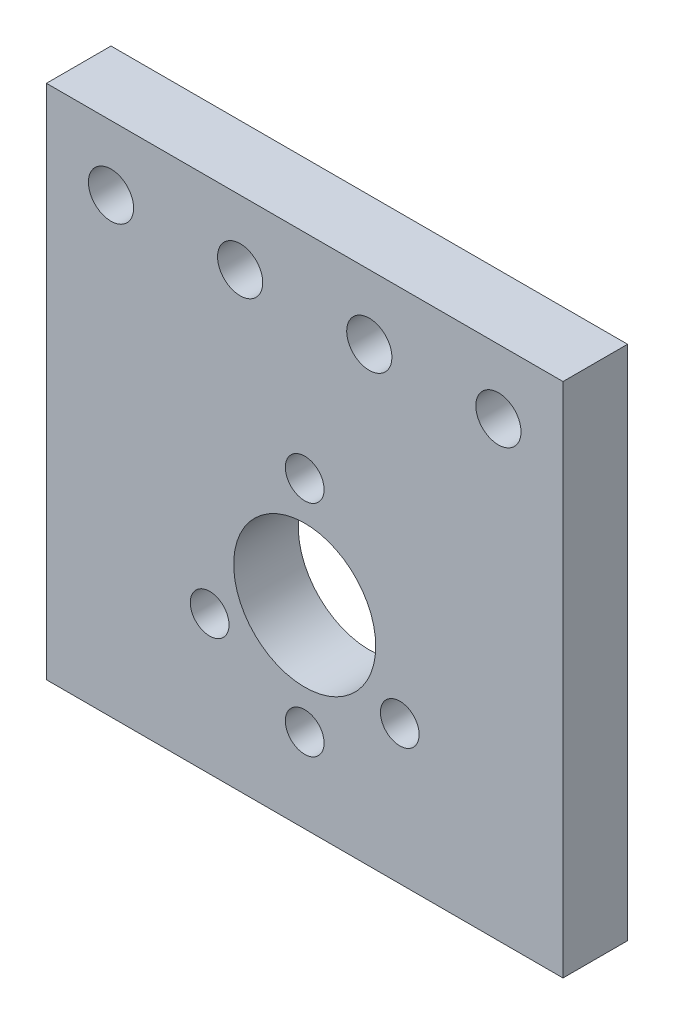
ISO-10303-21;
HEADER;
FILE_DESCRIPTION(('STEP AP214'),'2;1');
FILE_NAME('part.step','',(''),(''),'','','');
FILE_SCHEMA(('AUTOMOTIVE_DESIGN { 1 0 10303 214 1 1 1 1 }'));
ENDSEC;
DATA;
#1=APPLICATION_CONTEXT('core data for automotive mechanical design processes');
#2=APPLICATION_PROTOCOL_DEFINITION('international standard','automotive_design',2000,#1);
#3=PRODUCT_CONTEXT('',#1,'mechanical');
#4=PRODUCT('Part','Part','',(#3));
#5=PRODUCT_RELATED_PRODUCT_CATEGORY('part','',(#4));
#6=PRODUCT_DEFINITION_FORMATION('','',#4);
#7=PRODUCT_DEFINITION_CONTEXT('part definition',#1,'design');
#8=PRODUCT_DEFINITION('design','',#6,#7);
#9=PRODUCT_DEFINITION_SHAPE('','',#8);
#10=(LENGTH_UNIT() NAMED_UNIT(*) SI_UNIT(.MILLI.,.METRE.));
#11=(NAMED_UNIT(*) PLANE_ANGLE_UNIT() SI_UNIT($,.RADIAN.));
#12=(NAMED_UNIT(*) SI_UNIT($,.STERADIAN.) SOLID_ANGLE_UNIT());
#13=UNCERTAINTY_MEASURE_WITH_UNIT(LENGTH_MEASURE(1.E-05),#10,'distance_accuracy_value','');
#14=(GEOMETRIC_REPRESENTATION_CONTEXT(3) GLOBAL_UNCERTAINTY_ASSIGNED_CONTEXT((#13)) GLOBAL_UNIT_ASSIGNED_CONTEXT((#10,
#11,#12)) REPRESENTATION_CONTEXT('',''));
#15=CARTESIAN_POINT('',(0.,0.,0.));
#16=DIRECTION('',(0.,0.,1.));
#17=DIRECTION('',(1.,0.,0.));
#18=AXIS2_PLACEMENT_3D('',#15,#16,#17);
#19=CARTESIAN_POINT('',(0.,0.,5.));
#20=DIRECTION('',(0.,0.,1.));
#21=DIRECTION('',(1.,0.,0.));
#22=AXIS2_PLACEMENT_3D('',#19,#20,#21);
#23=PLANE('',#22);
#24=CARTESIAN_POINT('',(5.,20.,5.));
#25=DIRECTION('',(0.,0.,1.));
#26=DIRECTION('',(-1.,0.,0.));
#27=AXIS2_PLACEMENT_3D('',#24,#25,#26);
#28=CIRCLE('',#27,1.75);
#29=CARTESIAN_POINT('',(3.25,20.,5.));
#30=VERTEX_POINT('',#29);
#31=EDGE_CURVE('E151',#30,#30,#28,.T.);
#32=ORIENTED_EDGE('',*,*,#31,.F.);
#33=EDGE_LOOP('',(#32));
#34=FACE_BOUND('',#33,.T.);
#35=CARTESIAN_POINT('',(-15.,20.,5.));
#36=DIRECTION('',(0.,0.,1.));
#37=DIRECTION('',(1.,0.,0.));
#38=AXIS2_PLACEMENT_3D('',#35,#36,#37);
#39=CIRCLE('',#38,1.75);
#40=CARTESIAN_POINT('',(-13.25,20.,5.));
#41=VERTEX_POINT('',#40);
#42=EDGE_CURVE('E139',#41,#41,#39,.T.);
#43=ORIENTED_EDGE('',*,*,#42,.F.);
#44=EDGE_LOOP('',(#43));
#45=FACE_BOUND('',#44,.T.);
#46=CARTESIAN_POINT('',(7.36121593216774,-4.24999999999998,5.));
#47=DIRECTION('',(0.,0.,1.));
#48=DIRECTION('',(1.,0.,0.));
#49=AXIS2_PLACEMENT_3D('',#46,#47,#48);
#50=CIRCLE('',#49,1.5);
#51=CARTESIAN_POINT('',(8.86121593216774,-4.24999999999998,5.));
#52=VERTEX_POINT('',#51);
#53=EDGE_CURVE('E127',#52,#52,#50,.T.);
#54=ORIENTED_EDGE('',*,*,#53,.F.);
#55=EDGE_LOOP('',(#54));
#56=FACE_BOUND('',#55,.T.);
#57=CARTESIAN_POINT('',(0.,-8.5,5.));
#58=DIRECTION('',(0.,0.,1.));
#59=DIRECTION('',(1.,0.,0.));
#60=AXIS2_PLACEMENT_3D('',#57,#58,#59);
#61=CIRCLE('',#60,1.5);
#62=CARTESIAN_POINT('',(1.5,-8.5,5.));
#63=VERTEX_POINT('',#62);
#64=EDGE_CURVE('E115',#63,#63,#61,.T.);
#65=ORIENTED_EDGE('',*,*,#64,.F.);
#66=EDGE_LOOP('',(#65));
#67=FACE_BOUND('',#66,.T.);
#68=DIRECTION('',(0.,-1.,0.));
#69=VECTOR('',#68,1.);
#70=CARTESIAN_POINT('',(-20.,25.,5.));
#71=LINE('',#70,#69);
#72=CARTESIAN_POINT('',(-20.,25.,5.));
#73=VERTEX_POINT('',#72);
#74=CARTESIAN_POINT('',(-20.,-15.,5.));
#75=VERTEX_POINT('',#74);
#76=EDGE_CURVE('E85',#73,#75,#71,.T.);
#77=ORIENTED_EDGE('',*,*,#76,.T.);
#78=DIRECTION('',(1.,0.,0.));
#79=VECTOR('',#78,1.);
#80=CARTESIAN_POINT('',(-20.,-15.,5.));
#81=LINE('',#80,#79);
#82=CARTESIAN_POINT('',(20.,-15.,5.));
#83=VERTEX_POINT('',#82);
#84=EDGE_CURVE('E80',#75,#83,#81,.T.);
#85=ORIENTED_EDGE('',*,*,#84,.T.);
#86=DIRECTION('',(0.,1.,0.));
#87=VECTOR('',#86,1.);
#88=CARTESIAN_POINT('',(20.,25.,5.));
#89=LINE('',#88,#87);
#90=CARTESIAN_POINT('',(20.,25.,5.));
#91=VERTEX_POINT('',#90);
#92=EDGE_CURVE('E83',#83,#91,#89,.T.);
#93=ORIENTED_EDGE('',*,*,#92,.T.);
#94=DIRECTION('',(-1.,0.,0.));
#95=VECTOR('',#94,1.);
#96=CARTESIAN_POINT('',(-20.,25.,5.));
#97=LINE('',#96,#95);
#98=EDGE_CURVE('E50',#91,#73,#97,.T.);
#99=ORIENTED_EDGE('',*,*,#98,.T.);
#100=EDGE_LOOP('',(#77,#85,#93,#99));
#101=FACE_BOUND('',#100,.T.);
#102=CARTESIAN_POINT('',(0.,0.,5.));
#103=DIRECTION('',(0.,0.,1.));
#104=DIRECTION('',(1.,0.,0.));
#105=AXIS2_PLACEMENT_3D('',#102,#103,#104);
#106=CIRCLE('',#105,5.5);
#107=CARTESIAN_POINT('',(5.5,0.,5.));
#108=VERTEX_POINT('',#107);
#109=EDGE_CURVE('E100',#108,#108,#106,.T.);
#110=ORIENTED_EDGE('',*,*,#109,.F.);
#111=EDGE_LOOP('',(#110));
#112=FACE_BOUND('',#111,.T.);
#113=CARTESIAN_POINT('',(0.,8.5,5.));
#114=DIRECTION('',(0.,0.,1.));
#115=DIRECTION('',(1.,0.,0.));
#116=AXIS2_PLACEMENT_3D('',#113,#114,#115);
#117=CIRCLE('',#116,1.5);
#118=CARTESIAN_POINT('',(1.5,8.5,5.));
#119=VERTEX_POINT('',#118);
#120=EDGE_CURVE('E121',#119,#119,#117,.T.);
#121=ORIENTED_EDGE('',*,*,#120,.F.);
#122=EDGE_LOOP('',(#121));
#123=FACE_BOUND('',#122,.T.);
#124=CARTESIAN_POINT('',(-7.36121593216771,-4.25000000000003,5.));
#125=DIRECTION('',(0.,0.,1.));
#126=DIRECTION('',(-1.,0.,0.));
#127=AXIS2_PLACEMENT_3D('',#124,#125,#126);
#128=CIRCLE('',#127,1.5);
#129=CARTESIAN_POINT('',(-8.86121593216771,-4.25000000000003,5.));
#130=VERTEX_POINT('',#129);
#131=EDGE_CURVE('E133',#130,#130,#128,.T.);
#132=ORIENTED_EDGE('',*,*,#131,.F.);
#133=EDGE_LOOP('',(#132));
#134=FACE_BOUND('',#133,.T.);
#135=CARTESIAN_POINT('',(-5.,20.,5.));
#136=DIRECTION('',(0.,0.,1.));
#137=DIRECTION('',(1.,0.,0.));
#138=AXIS2_PLACEMENT_3D('',#135,#136,#137);
#139=CIRCLE('',#138,1.75);
#140=CARTESIAN_POINT('',(-3.25,20.,5.));
#141=VERTEX_POINT('',#140);
#142=EDGE_CURVE('E145',#141,#141,#139,.T.);
#143=ORIENTED_EDGE('',*,*,#142,.F.);
#144=EDGE_LOOP('',(#143));
#145=FACE_BOUND('',#144,.T.);
#146=CARTESIAN_POINT('',(15.,20.,5.));
#147=DIRECTION('',(0.,0.,1.));
#148=DIRECTION('',(-1.,0.,0.));
#149=AXIS2_PLACEMENT_3D('',#146,#147,#148);
#150=CIRCLE('',#149,1.75);
#151=CARTESIAN_POINT('',(13.25,20.,5.));
#152=VERTEX_POINT('',#151);
#153=EDGE_CURVE('E157',#152,#152,#150,.T.);
#154=ORIENTED_EDGE('',*,*,#153,.F.);
#155=EDGE_LOOP('',(#154));
#156=FACE_BOUND('',#155,.T.);
#157=ADVANCED_FACE('F33',(#34,#45,#56,#67,#101,#112,#123,#134,#145,#156),#23,.T.);
#158=CARTESIAN_POINT('',(0.,0.,0.));
#159=DIRECTION('',(0.,0.,1.));
#160=DIRECTION('',(1.,0.,0.));
#161=AXIS2_PLACEMENT_3D('',#158,#159,#160);
#162=PLANE('',#161);
#163=CARTESIAN_POINT('',(5.,20.,0.));
#164=DIRECTION('',(0.,0.,1.));
#165=DIRECTION('',(-1.,0.,0.));
#166=AXIS2_PLACEMENT_3D('',#163,#164,#165);
#167=CIRCLE('',#166,1.75);
#168=CARTESIAN_POINT('',(3.25,20.,0.));
#169=VERTEX_POINT('',#168);
#170=EDGE_CURVE('E154',#169,#169,#167,.T.);
#171=ORIENTED_EDGE('',*,*,#170,.T.);
#172=EDGE_LOOP('',(#171));
#173=FACE_BOUND('',#172,.T.);
#174=CARTESIAN_POINT('',(-15.,20.,0.));
#175=DIRECTION('',(0.,0.,1.));
#176=DIRECTION('',(1.,0.,0.));
#177=AXIS2_PLACEMENT_3D('',#174,#175,#176);
#178=CIRCLE('',#177,1.75);
#179=CARTESIAN_POINT('',(-13.25,20.,0.));
#180=VERTEX_POINT('',#179);
#181=EDGE_CURVE('E142',#180,#180,#178,.T.);
#182=ORIENTED_EDGE('',*,*,#181,.T.);
#183=EDGE_LOOP('',(#182));
#184=FACE_BOUND('',#183,.T.);
#185=CARTESIAN_POINT('',(7.36121593216774,-4.24999999999998,0.));
#186=DIRECTION('',(0.,0.,1.));
#187=DIRECTION('',(1.,0.,0.));
#188=AXIS2_PLACEMENT_3D('',#185,#186,#187);
#189=CIRCLE('',#188,1.5);
#190=CARTESIAN_POINT('',(8.86121593216774,-4.24999999999998,0.));
#191=VERTEX_POINT('',#190);
#192=EDGE_CURVE('E130',#191,#191,#189,.T.);
#193=ORIENTED_EDGE('',*,*,#192,.T.);
#194=EDGE_LOOP('',(#193));
#195=FACE_BOUND('',#194,.T.);
#196=CARTESIAN_POINT('',(0.,-8.5,0.));
#197=DIRECTION('',(0.,0.,1.));
#198=DIRECTION('',(1.,0.,0.));
#199=AXIS2_PLACEMENT_3D('',#196,#197,#198);
#200=CIRCLE('',#199,1.5);
#201=CARTESIAN_POINT('',(1.5,-8.5,0.));
#202=VERTEX_POINT('',#201);
#203=EDGE_CURVE('E118',#202,#202,#200,.T.);
#204=ORIENTED_EDGE('',*,*,#203,.T.);
#205=EDGE_LOOP('',(#204));
#206=FACE_BOUND('',#205,.T.);
#207=DIRECTION('',(0.,-1.,0.));
#208=VECTOR('',#207,1.);
#209=CARTESIAN_POINT('',(-20.,25.,0.));
#210=LINE('',#209,#208);
#211=CARTESIAN_POINT('',(-20.,25.,0.));
#212=VERTEX_POINT('',#211);
#213=CARTESIAN_POINT('',(-20.,-15.,0.));
#214=VERTEX_POINT('',#213);
#215=EDGE_CURVE('E97',#212,#214,#210,.T.);
#216=ORIENTED_EDGE('',*,*,#215,.F.);
#217=DIRECTION('',(-1.,0.,0.));
#218=VECTOR('',#217,1.);
#219=CARTESIAN_POINT('',(-20.,25.,0.));
#220=LINE('',#219,#218);
#221=CARTESIAN_POINT('',(20.,25.,0.));
#222=VERTEX_POINT('',#221);
#223=EDGE_CURVE('E73',#222,#212,#220,.T.);
#224=ORIENTED_EDGE('',*,*,#223,.F.);
#225=DIRECTION('',(0.,1.,0.));
#226=VECTOR('',#225,1.);
#227=CARTESIAN_POINT('',(20.,25.,0.));
#228=LINE('',#227,#226);
#229=CARTESIAN_POINT('',(20.,-15.,0.));
#230=VERTEX_POINT('',#229);
#231=EDGE_CURVE('E67',#230,#222,#228,.T.);
#232=ORIENTED_EDGE('',*,*,#231,.F.);
#233=DIRECTION('',(1.,0.,0.));
#234=VECTOR('',#233,1.);
#235=CARTESIAN_POINT('',(-20.,-15.,0.));
#236=LINE('',#235,#234);
#237=EDGE_CURVE('E89',#214,#230,#236,.T.);
#238=ORIENTED_EDGE('',*,*,#237,.F.);
#239=EDGE_LOOP('',(#216,#224,#232,#238));
#240=FACE_BOUND('',#239,.T.);
#241=CARTESIAN_POINT('',(0.,0.,0.));
#242=DIRECTION('',(0.,0.,1.));
#243=DIRECTION('',(1.,0.,0.));
#244=AXIS2_PLACEMENT_3D('',#241,#242,#243);
#245=CIRCLE('',#244,5.5);
#246=CARTESIAN_POINT('',(5.5,0.,0.));
#247=VERTEX_POINT('',#246);
#248=EDGE_CURVE('E112',#247,#247,#245,.T.);
#249=ORIENTED_EDGE('',*,*,#248,.T.);
#250=EDGE_LOOP('',(#249));
#251=FACE_BOUND('',#250,.T.);
#252=CARTESIAN_POINT('',(0.,8.5,0.));
#253=DIRECTION('',(0.,0.,1.));
#254=DIRECTION('',(1.,0.,0.));
#255=AXIS2_PLACEMENT_3D('',#252,#253,#254);
#256=CIRCLE('',#255,1.5);
#257=CARTESIAN_POINT('',(1.5,8.5,0.));
#258=VERTEX_POINT('',#257);
#259=EDGE_CURVE('E124',#258,#258,#256,.T.);
#260=ORIENTED_EDGE('',*,*,#259,.T.);
#261=EDGE_LOOP('',(#260));
#262=FACE_BOUND('',#261,.T.);
#263=CARTESIAN_POINT('',(-7.36121593216771,-4.25000000000003,0.));
#264=DIRECTION('',(0.,0.,1.));
#265=DIRECTION('',(-1.,0.,0.));
#266=AXIS2_PLACEMENT_3D('',#263,#264,#265);
#267=CIRCLE('',#266,1.5);
#268=CARTESIAN_POINT('',(-8.86121593216771,-4.25000000000003,0.));
#269=VERTEX_POINT('',#268);
#270=EDGE_CURVE('E136',#269,#269,#267,.T.);
#271=ORIENTED_EDGE('',*,*,#270,.T.);
#272=EDGE_LOOP('',(#271));
#273=FACE_BOUND('',#272,.T.);
#274=CARTESIAN_POINT('',(-5.,20.,0.));
#275=DIRECTION('',(0.,0.,1.));
#276=DIRECTION('',(1.,0.,0.));
#277=AXIS2_PLACEMENT_3D('',#274,#275,#276);
#278=CIRCLE('',#277,1.75);
#279=CARTESIAN_POINT('',(-3.25,20.,0.));
#280=VERTEX_POINT('',#279);
#281=EDGE_CURVE('E148',#280,#280,#278,.T.);
#282=ORIENTED_EDGE('',*,*,#281,.T.);
#283=EDGE_LOOP('',(#282));
#284=FACE_BOUND('',#283,.T.);
#285=CARTESIAN_POINT('',(15.,20.,0.));
#286=DIRECTION('',(0.,0.,1.));
#287=DIRECTION('',(-1.,0.,0.));
#288=AXIS2_PLACEMENT_3D('',#285,#286,#287);
#289=CIRCLE('',#288,1.75);
#290=CARTESIAN_POINT('',(13.25,20.,0.));
#291=VERTEX_POINT('',#290);
#292=EDGE_CURVE('E160',#291,#291,#289,.T.);
#293=ORIENTED_EDGE('',*,*,#292,.T.);
#294=EDGE_LOOP('',(#293));
#295=FACE_BOUND('',#294,.T.);
#296=ADVANCED_FACE('F108',(#173,#184,#195,#206,#240,#251,#262,#273,#284,#295),#162,.F.);
#297=CARTESIAN_POINT('',(-20.,25.,5.));
#298=DIRECTION('',(1.,0.,0.));
#299=DIRECTION('',(0.,0.,-1.));
#300=AXIS2_PLACEMENT_3D('',#297,#298,#299);
#301=PLANE('',#300);
#302=ORIENTED_EDGE('',*,*,#215,.T.);
#303=DIRECTION('',(0.,0.,-1.));
#304=VECTOR('',#303,1.);
#305=CARTESIAN_POINT('',(-20.,-15.,5.));
#306=LINE('',#305,#304);
#307=EDGE_CURVE('E11',#75,#214,#306,.T.);
#308=ORIENTED_EDGE('',*,*,#307,.F.);
#309=ORIENTED_EDGE('',*,*,#76,.F.);
#310=DIRECTION('',(0.,0.,-1.));
#311=VECTOR('',#310,1.);
#312=CARTESIAN_POINT('',(-20.,25.,5.));
#313=LINE('',#312,#311);
#314=EDGE_CURVE('E93',#73,#212,#313,.T.);
#315=ORIENTED_EDGE('',*,*,#314,.T.);
#316=EDGE_LOOP('',(#302,#308,#309,#315));
#317=FACE_BOUND('',#316,.T.);
#318=ADVANCED_FACE('F35',(#317),#301,.F.);
#319=CARTESIAN_POINT('',(-20.,-15.,5.));
#320=DIRECTION('',(0.,1.,0.));
#321=DIRECTION('',(0.,0.,1.));
#322=AXIS2_PLACEMENT_3D('',#319,#320,#321);
#323=PLANE('',#322);
#324=ORIENTED_EDGE('',*,*,#237,.T.);
#325=DIRECTION('',(0.,0.,-1.));
#326=VECTOR('',#325,1.);
#327=CARTESIAN_POINT('',(20.,-15.,5.));
#328=LINE('',#327,#326);
#329=EDGE_CURVE('E42',#83,#230,#328,.T.);
#330=ORIENTED_EDGE('',*,*,#329,.F.);
#331=ORIENTED_EDGE('',*,*,#84,.F.);
#332=ORIENTED_EDGE('',*,*,#307,.T.);
#333=EDGE_LOOP('',(#324,#330,#331,#332));
#334=FACE_BOUND('',#333,.T.);
#335=ADVANCED_FACE('F88',(#334),#323,.F.);
#336=CARTESIAN_POINT('',(20.,25.,5.));
#337=DIRECTION('',(-1.,0.,0.));
#338=DIRECTION('',(0.,0.,1.));
#339=AXIS2_PLACEMENT_3D('',#336,#337,#338);
#340=PLANE('',#339);
#341=ORIENTED_EDGE('',*,*,#231,.T.);
#342=DIRECTION('',(0.,0.,-1.));
#343=VECTOR('',#342,1.);
#344=CARTESIAN_POINT('',(20.,25.,5.));
#345=LINE('',#344,#343);
#346=EDGE_CURVE('E90',#91,#222,#345,.T.);
#347=ORIENTED_EDGE('',*,*,#346,.F.);
#348=ORIENTED_EDGE('',*,*,#92,.F.);
#349=ORIENTED_EDGE('',*,*,#329,.T.);
#350=EDGE_LOOP('',(#341,#347,#348,#349));
#351=FACE_BOUND('',#350,.T.);
#352=ADVANCED_FACE('F91',(#351),#340,.F.);
#353=CARTESIAN_POINT('',(-20.,25.,5.));
#354=DIRECTION('',(0.,-1.,0.));
#355=DIRECTION('',(0.,0.,-1.));
#356=AXIS2_PLACEMENT_3D('',#353,#354,#355);
#357=PLANE('',#356);
#358=ORIENTED_EDGE('',*,*,#223,.T.);
#359=ORIENTED_EDGE('',*,*,#314,.F.);
#360=ORIENTED_EDGE('',*,*,#98,.F.);
#361=ORIENTED_EDGE('',*,*,#346,.T.);
#362=EDGE_LOOP('',(#358,#359,#360,#361));
#363=FACE_BOUND('',#362,.T.);
#364=ADVANCED_FACE('F105',(#363),#357,.F.);
#365=CARTESIAN_POINT('',(0.,0.,5.));
#366=DIRECTION('',(0.,0.,-1.));
#367=DIRECTION('',(-1.,0.,0.));
#368=AXIS2_PLACEMENT_3D('',#365,#366,#367);
#369=CYLINDRICAL_SURFACE('',#368,5.5);
#370=ORIENTED_EDGE('',*,*,#109,.T.);
#371=EDGE_LOOP('',(#370));
#372=FACE_BOUND('',#371,.T.);
#373=ORIENTED_EDGE('',*,*,#248,.F.);
#374=EDGE_LOOP('',(#373));
#375=FACE_BOUND('',#374,.T.);
#376=ADVANCED_FACE('F180',(#372,#375),#369,.F.);
#377=CARTESIAN_POINT('',(0.,-8.5,5.));
#378=DIRECTION('',(0.,0.,-1.));
#379=DIRECTION('',(-1.,0.,0.));
#380=AXIS2_PLACEMENT_3D('',#377,#378,#379);
#381=CYLINDRICAL_SURFACE('',#380,1.5);
#382=ORIENTED_EDGE('',*,*,#64,.T.);
#383=EDGE_LOOP('',(#382));
#384=FACE_BOUND('',#383,.T.);
#385=ORIENTED_EDGE('',*,*,#203,.F.);
#386=EDGE_LOOP('',(#385));
#387=FACE_BOUND('',#386,.T.);
#388=ADVANCED_FACE('F226',(#384,#387),#381,.F.);
#389=CARTESIAN_POINT('',(0.,8.5,5.));
#390=DIRECTION('',(0.,0.,-1.));
#391=DIRECTION('',(-1.,0.,0.));
#392=AXIS2_PLACEMENT_3D('',#389,#390,#391);
#393=CYLINDRICAL_SURFACE('',#392,1.5);
#394=ORIENTED_EDGE('',*,*,#120,.T.);
#395=EDGE_LOOP('',(#394));
#396=FACE_BOUND('',#395,.T.);
#397=ORIENTED_EDGE('',*,*,#259,.F.);
#398=EDGE_LOOP('',(#397));
#399=FACE_BOUND('',#398,.T.);
#400=ADVANCED_FACE('F234',(#396,#399),#393,.F.);
#401=CARTESIAN_POINT('',(7.36121593216774,-4.24999999999998,5.));
#402=DIRECTION('',(0.,0.,-1.));
#403=DIRECTION('',(-1.,0.,0.));
#404=AXIS2_PLACEMENT_3D('',#401,#402,#403);
#405=CYLINDRICAL_SURFACE('',#404,1.5);
#406=ORIENTED_EDGE('',*,*,#53,.T.);
#407=EDGE_LOOP('',(#406));
#408=FACE_BOUND('',#407,.T.);
#409=ORIENTED_EDGE('',*,*,#192,.F.);
#410=EDGE_LOOP('',(#409));
#411=FACE_BOUND('',#410,.T.);
#412=ADVANCED_FACE('F242',(#408,#411),#405,.F.);
#413=CARTESIAN_POINT('',(-7.36121593216771,-4.25000000000003,5.));
#414=DIRECTION('',(0.,0.,-1.));
#415=DIRECTION('',(-1.,0.,0.));
#416=AXIS2_PLACEMENT_3D('',#413,#414,#415);
#417=CYLINDRICAL_SURFACE('',#416,1.5);
#418=ORIENTED_EDGE('',*,*,#131,.T.);
#419=EDGE_LOOP('',(#418));
#420=FACE_BOUND('',#419,.T.);
#421=ORIENTED_EDGE('',*,*,#270,.F.);
#422=EDGE_LOOP('',(#421));
#423=FACE_BOUND('',#422,.T.);
#424=ADVANCED_FACE('F251',(#420,#423),#417,.F.);
#425=CARTESIAN_POINT('',(-15.,20.,5.));
#426=DIRECTION('',(0.,0.,-1.));
#427=DIRECTION('',(-1.,0.,0.));
#428=AXIS2_PLACEMENT_3D('',#425,#426,#427);
#429=CYLINDRICAL_SURFACE('',#428,1.75);
#430=ORIENTED_EDGE('',*,*,#42,.T.);
#431=EDGE_LOOP('',(#430));
#432=FACE_BOUND('',#431,.T.);
#433=ORIENTED_EDGE('',*,*,#181,.F.);
#434=EDGE_LOOP('',(#433));
#435=FACE_BOUND('',#434,.T.);
#436=ADVANCED_FACE('F260',(#432,#435),#429,.F.);
#437=CARTESIAN_POINT('',(-5.,20.,5.));
#438=DIRECTION('',(0.,0.,-1.));
#439=DIRECTION('',(-1.,0.,0.));
#440=AXIS2_PLACEMENT_3D('',#437,#438,#439);
#441=CYLINDRICAL_SURFACE('',#440,1.75);
#442=ORIENTED_EDGE('',*,*,#142,.T.);
#443=EDGE_LOOP('',(#442));
#444=FACE_BOUND('',#443,.T.);
#445=ORIENTED_EDGE('',*,*,#281,.F.);
#446=EDGE_LOOP('',(#445));
#447=FACE_BOUND('',#446,.T.);
#448=ADVANCED_FACE('F269',(#444,#447),#441,.F.);
#449=CARTESIAN_POINT('',(5.,20.,5.));
#450=DIRECTION('',(0.,0.,-1.));
#451=DIRECTION('',(-1.,0.,0.));
#452=AXIS2_PLACEMENT_3D('',#449,#450,#451);
#453=CYLINDRICAL_SURFACE('',#452,1.75);
#454=ORIENTED_EDGE('',*,*,#31,.T.);
#455=EDGE_LOOP('',(#454));
#456=FACE_BOUND('',#455,.T.);
#457=ORIENTED_EDGE('',*,*,#170,.F.);
#458=EDGE_LOOP('',(#457));
#459=FACE_BOUND('',#458,.T.);
#460=ADVANCED_FACE('F278',(#456,#459),#453,.F.);
#461=CARTESIAN_POINT('',(15.,20.,5.));
#462=DIRECTION('',(0.,0.,-1.));
#463=DIRECTION('',(-1.,0.,0.));
#464=AXIS2_PLACEMENT_3D('',#461,#462,#463);
#465=CYLINDRICAL_SURFACE('',#464,1.75);
#466=ORIENTED_EDGE('',*,*,#153,.T.);
#467=EDGE_LOOP('',(#466));
#468=FACE_BOUND('',#467,.T.);
#469=ORIENTED_EDGE('',*,*,#292,.F.);
#470=EDGE_LOOP('',(#469));
#471=FACE_BOUND('',#470,.T.);
#472=ADVANCED_FACE('F166',(#468,#471),#465,.F.);
#473=CLOSED_SHELL('',(#157,#296,#318,#335,#352,#364,#376,#388,#400,#412,#424,#436,#448,#460,#472));
#474=MANIFOLD_SOLID_BREP('B2',#473);
#475=ADVANCED_BREP_SHAPE_REPRESENTATION('',(#18,#474),#14);
#476=SHAPE_DEFINITION_REPRESENTATION(#9,#475);
ENDSEC;
END-ISO-10303-21;
